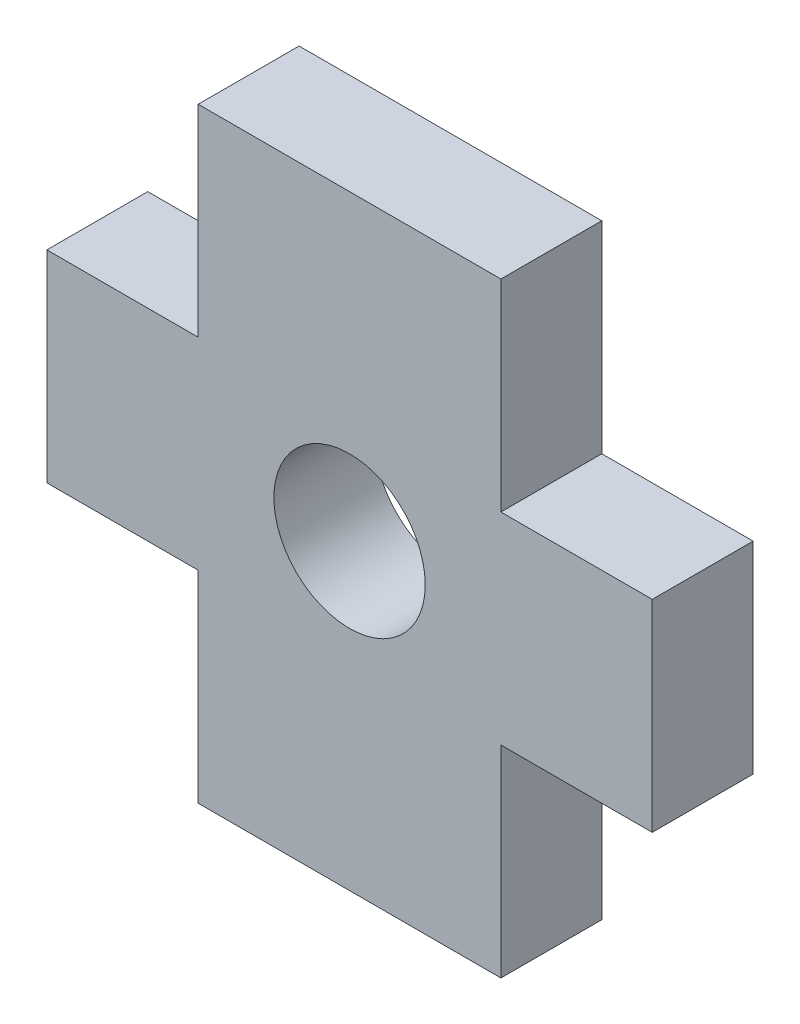
ISO-10303-21;
HEADER;
FILE_DESCRIPTION(('STEP AP214'),'2;1');
FILE_NAME('part.step','',(''),(''),'','','');
FILE_SCHEMA(('AUTOMOTIVE_DESIGN { 1 0 10303 214 1 1 1 1 }'));
ENDSEC;
DATA;
#1=APPLICATION_CONTEXT('core data for automotive mechanical design processes');
#2=APPLICATION_PROTOCOL_DEFINITION('international standard','automotive_design',2000,#1);
#3=PRODUCT_CONTEXT('',#1,'mechanical');
#4=PRODUCT('Part','Part','',(#3));
#5=PRODUCT_RELATED_PRODUCT_CATEGORY('part','',(#4));
#6=PRODUCT_DEFINITION_FORMATION('','',#4);
#7=PRODUCT_DEFINITION_CONTEXT('part definition',#1,'design');
#8=PRODUCT_DEFINITION('design','',#6,#7);
#9=PRODUCT_DEFINITION_SHAPE('','',#8);
#10=(LENGTH_UNIT() NAMED_UNIT(*) SI_UNIT(.MILLI.,.METRE.));
#11=(NAMED_UNIT(*) PLANE_ANGLE_UNIT() SI_UNIT($,.RADIAN.));
#12=(NAMED_UNIT(*) SI_UNIT($,.STERADIAN.) SOLID_ANGLE_UNIT());
#13=UNCERTAINTY_MEASURE_WITH_UNIT(LENGTH_MEASURE(1.E-05),#10,'distance_accuracy_value','');
#14=(GEOMETRIC_REPRESENTATION_CONTEXT(3) GLOBAL_UNCERTAINTY_ASSIGNED_CONTEXT((#13)) GLOBAL_UNIT_ASSIGNED_CONTEXT((#10,
#11,#12)) REPRESENTATION_CONTEXT('',''));
#15=CARTESIAN_POINT('',(0.,0.,0.));
#16=DIRECTION('',(0.,0.,1.));
#17=DIRECTION('',(1.,0.,0.));
#18=AXIS2_PLACEMENT_3D('',#15,#16,#17);
#19=CARTESIAN_POINT('',(0.,0.,2.));
#20=DIRECTION('',(0.,0.,1.));
#21=DIRECTION('',(1.,0.,0.));
#22=AXIS2_PLACEMENT_3D('',#19,#20,#21);
#23=PLANE('',#22);
#24=DIRECTION('',(0.,-1.,0.));
#25=VECTOR('',#24,1.);
#26=CARTESIAN_POINT('',(-3.,-2.,2.));
#27=LINE('',#26,#25);
#28=CARTESIAN_POINT('',(-3.,-2.,2.));
#29=VERTEX_POINT('',#28);
#30=CARTESIAN_POINT('',(-3.,-6.,2.));
#31=VERTEX_POINT('',#30);
#32=EDGE_CURVE('E177',#29,#31,#27,.T.);
#33=ORIENTED_EDGE('',*,*,#32,.T.);
#34=DIRECTION('',(1.,0.,0.));
#35=VECTOR('',#34,1.);
#36=CARTESIAN_POINT('',(-3.,-6.,2.));
#37=LINE('',#36,#35);
#38=CARTESIAN_POINT('',(3.,-6.,2.));
#39=VERTEX_POINT('',#38);
#40=EDGE_CURVE('E105',#31,#39,#37,.T.);
#41=ORIENTED_EDGE('',*,*,#40,.T.);
#42=DIRECTION('',(0.,1.,0.));
#43=VECTOR('',#42,1.);
#44=CARTESIAN_POINT('',(3.,-6.,2.));
#45=LINE('',#44,#43);
#46=CARTESIAN_POINT('',(3.,-2.,2.));
#47=VERTEX_POINT('',#46);
#48=EDGE_CURVE('E204',#39,#47,#45,.T.);
#49=ORIENTED_EDGE('',*,*,#48,.T.);
#50=DIRECTION('',(1.,0.,0.));
#51=VECTOR('',#50,1.);
#52=CARTESIAN_POINT('',(3.,-2.,2.));
#53=LINE('',#52,#51);
#54=CARTESIAN_POINT('',(6.,-2.,2.));
#55=VERTEX_POINT('',#54);
#56=EDGE_CURVE('E223',#47,#55,#53,.T.);
#57=ORIENTED_EDGE('',*,*,#56,.T.);
#58=DIRECTION('',(0.,1.,0.));
#59=VECTOR('',#58,1.);
#60=CARTESIAN_POINT('',(6.,-2.,2.));
#61=LINE('',#60,#59);
#62=CARTESIAN_POINT('',(6.,2.,2.));
#63=VERTEX_POINT('',#62);
#64=EDGE_CURVE('E220',#55,#63,#61,.T.);
#65=ORIENTED_EDGE('',*,*,#64,.T.);
#66=DIRECTION('',(-1.,0.,0.));
#67=VECTOR('',#66,1.);
#68=CARTESIAN_POINT('',(3.,2.,2.));
#69=LINE('',#68,#67);
#70=CARTESIAN_POINT('',(3.,2.,2.));
#71=VERTEX_POINT('',#70);
#72=EDGE_CURVE('E222',#63,#71,#69,.T.);
#73=ORIENTED_EDGE('',*,*,#72,.T.);
#74=DIRECTION('',(0.,1.,0.));
#75=VECTOR('',#74,1.);
#76=CARTESIAN_POINT('',(3.,2.,2.));
#77=LINE('',#76,#75);
#78=CARTESIAN_POINT('',(3.,6.,2.));
#79=VERTEX_POINT('',#78);
#80=EDGE_CURVE('E225',#71,#79,#77,.T.);
#81=ORIENTED_EDGE('',*,*,#80,.T.);
#82=DIRECTION('',(-1.,0.,0.));
#83=VECTOR('',#82,1.);
#84=CARTESIAN_POINT('',(3.,6.,2.));
#85=LINE('',#84,#83);
#86=CARTESIAN_POINT('',(-3.,6.,2.));
#87=VERTEX_POINT('',#86);
#88=EDGE_CURVE('E231',#79,#87,#85,.T.);
#89=ORIENTED_EDGE('',*,*,#88,.T.);
#90=DIRECTION('',(0.,-1.,0.));
#91=VECTOR('',#90,1.);
#92=CARTESIAN_POINT('',(-3.,6.,2.));
#93=LINE('',#92,#91);
#94=CARTESIAN_POINT('',(-3.,2.,2.));
#95=VERTEX_POINT('',#94);
#96=EDGE_CURVE('E136',#87,#95,#93,.T.);
#97=ORIENTED_EDGE('',*,*,#96,.T.);
#98=DIRECTION('',(-1.,0.,0.));
#99=VECTOR('',#98,1.);
#100=CARTESIAN_POINT('',(-3.,2.,2.));
#101=LINE('',#100,#99);
#102=CARTESIAN_POINT('',(-6.,2.,2.));
#103=VERTEX_POINT('',#102);
#104=EDGE_CURVE('E130',#95,#103,#101,.T.);
#105=ORIENTED_EDGE('',*,*,#104,.T.);
#106=DIRECTION('',(0.,-1.,0.));
#107=VECTOR('',#106,1.);
#108=CARTESIAN_POINT('',(-6.,2.,2.));
#109=LINE('',#108,#107);
#110=CARTESIAN_POINT('',(-6.,-2.,2.));
#111=VERTEX_POINT('',#110);
#112=EDGE_CURVE('E134',#103,#111,#109,.T.);
#113=ORIENTED_EDGE('',*,*,#112,.T.);
#114=DIRECTION('',(1.,0.,0.));
#115=VECTOR('',#114,1.);
#116=CARTESIAN_POINT('',(-6.,-2.,2.));
#117=LINE('',#116,#115);
#118=EDGE_CURVE('E50',#111,#29,#117,.T.);
#119=ORIENTED_EDGE('',*,*,#118,.T.);
#120=EDGE_LOOP('',(#33,#41,#49,#57,#65,#73,#81,#89,#97,#105,#113,#119));
#121=FACE_BOUND('',#120,.T.);
#122=CARTESIAN_POINT('',(0.,0.,2.));
#123=DIRECTION('',(0.,0.,1.));
#124=DIRECTION('',(1.,0.,0.));
#125=AXIS2_PLACEMENT_3D('',#122,#123,#124);
#126=CIRCLE('',#125,1.5);
#127=CARTESIAN_POINT('',(1.5,0.,2.));
#128=VERTEX_POINT('',#127);
#129=EDGE_CURVE('E158',#128,#128,#126,.T.);
#130=ORIENTED_EDGE('',*,*,#129,.F.);
#131=EDGE_LOOP('',(#130));
#132=FACE_BOUND('',#131,.T.);
#133=ADVANCED_FACE('F33',(#121,#132),#23,.T.);
#134=CARTESIAN_POINT('',(0.,0.,0.));
#135=DIRECTION('',(0.,0.,1.));
#136=DIRECTION('',(1.,0.,0.));
#137=AXIS2_PLACEMENT_3D('',#134,#135,#136);
#138=PLANE('',#137);
#139=DIRECTION('',(0.,-1.,0.));
#140=VECTOR('',#139,1.);
#141=CARTESIAN_POINT('',(-3.,-2.,0.));
#142=LINE('',#141,#140);
#143=CARTESIAN_POINT('',(-3.,-2.,0.));
#144=VERTEX_POINT('',#143);
#145=CARTESIAN_POINT('',(-3.,-6.,0.));
#146=VERTEX_POINT('',#145);
#147=EDGE_CURVE('E154',#144,#146,#142,.T.);
#148=ORIENTED_EDGE('',*,*,#147,.F.);
#149=DIRECTION('',(1.,0.,0.));
#150=VECTOR('',#149,1.);
#151=CARTESIAN_POINT('',(-6.,-2.,0.));
#152=LINE('',#151,#150);
#153=CARTESIAN_POINT('',(-6.,-2.,0.));
#154=VERTEX_POINT('',#153);
#155=EDGE_CURVE('E97',#154,#144,#152,.T.);
#156=ORIENTED_EDGE('',*,*,#155,.F.);
#157=DIRECTION('',(0.,-1.,0.));
#158=VECTOR('',#157,1.);
#159=CARTESIAN_POINT('',(-6.,2.,0.));
#160=LINE('',#159,#158);
#161=CARTESIAN_POINT('',(-6.,2.,0.));
#162=VERTEX_POINT('',#161);
#163=EDGE_CURVE('E91',#162,#154,#160,.T.);
#164=ORIENTED_EDGE('',*,*,#163,.F.);
#165=DIRECTION('',(-1.,0.,0.));
#166=VECTOR('',#165,1.);
#167=CARTESIAN_POINT('',(-3.,2.,0.));
#168=LINE('',#167,#166);
#169=CARTESIAN_POINT('',(-3.,2.,0.));
#170=VERTEX_POINT('',#169);
#171=EDGE_CURVE('E144',#170,#162,#168,.T.);
#172=ORIENTED_EDGE('',*,*,#171,.F.);
#173=DIRECTION('',(0.,-1.,0.));
#174=VECTOR('',#173,1.);
#175=CARTESIAN_POINT('',(-3.,6.,0.));
#176=LINE('',#175,#174);
#177=CARTESIAN_POINT('',(-3.,6.,0.));
#178=VERTEX_POINT('',#177);
#179=EDGE_CURVE('E172',#178,#170,#176,.T.);
#180=ORIENTED_EDGE('',*,*,#179,.F.);
#181=DIRECTION('',(-1.,0.,0.));
#182=VECTOR('',#181,1.);
#183=CARTESIAN_POINT('',(3.,6.,0.));
#184=LINE('',#183,#182);
#185=CARTESIAN_POINT('',(3.,6.,0.));
#186=VERTEX_POINT('',#185);
#187=EDGE_CURVE('E170',#186,#178,#184,.T.);
#188=ORIENTED_EDGE('',*,*,#187,.F.);
#189=DIRECTION('',(0.,1.,0.));
#190=VECTOR('',#189,1.);
#191=CARTESIAN_POINT('',(3.,2.,0.));
#192=LINE('',#191,#190);
#193=CARTESIAN_POINT('',(3.,2.,0.));
#194=VERTEX_POINT('',#193);
#195=EDGE_CURVE('E168',#194,#186,#192,.T.);
#196=ORIENTED_EDGE('',*,*,#195,.F.);
#197=DIRECTION('',(-1.,0.,0.));
#198=VECTOR('',#197,1.);
#199=CARTESIAN_POINT('',(3.,2.,0.));
#200=LINE('',#199,#198);
#201=CARTESIAN_POINT('',(6.,2.,0.));
#202=VERTEX_POINT('',#201);
#203=EDGE_CURVE('E166',#202,#194,#200,.T.);
#204=ORIENTED_EDGE('',*,*,#203,.F.);
#205=DIRECTION('',(0.,1.,0.));
#206=VECTOR('',#205,1.);
#207=CARTESIAN_POINT('',(6.,-2.,0.));
#208=LINE('',#207,#206);
#209=CARTESIAN_POINT('',(6.,-2.,0.));
#210=VERTEX_POINT('',#209);
#211=EDGE_CURVE('E164',#210,#202,#208,.T.);
#212=ORIENTED_EDGE('',*,*,#211,.F.);
#213=DIRECTION('',(1.,0.,0.));
#214=VECTOR('',#213,1.);
#215=CARTESIAN_POINT('',(3.,-2.,0.));
#216=LINE('',#215,#214);
#217=CARTESIAN_POINT('',(3.,-2.,0.));
#218=VERTEX_POINT('',#217);
#219=EDGE_CURVE('E162',#218,#210,#216,.T.);
#220=ORIENTED_EDGE('',*,*,#219,.F.);
#221=DIRECTION('',(0.,1.,0.));
#222=VECTOR('',#221,1.);
#223=CARTESIAN_POINT('',(3.,-6.,0.));
#224=LINE('',#223,#222);
#225=CARTESIAN_POINT('',(3.,-6.,0.));
#226=VERTEX_POINT('',#225);
#227=EDGE_CURVE('E160',#226,#218,#224,.T.);
#228=ORIENTED_EDGE('',*,*,#227,.F.);
#229=DIRECTION('',(1.,0.,0.));
#230=VECTOR('',#229,1.);
#231=CARTESIAN_POINT('',(-3.,-6.,0.));
#232=LINE('',#231,#230);
#233=EDGE_CURVE('E157',#146,#226,#232,.T.);
#234=ORIENTED_EDGE('',*,*,#233,.F.);
#235=EDGE_LOOP('',(#148,#156,#164,#172,#180,#188,#196,#204,#212,#220,#228,#234));
#236=FACE_BOUND('',#235,.T.);
#237=CARTESIAN_POINT('',(0.,0.,0.));
#238=DIRECTION('',(0.,0.,1.));
#239=DIRECTION('',(1.,0.,0.));
#240=AXIS2_PLACEMENT_3D('',#237,#238,#239);
#241=CIRCLE('',#240,1.5);
#242=CARTESIAN_POINT('',(1.5,0.,0.));
#243=VERTEX_POINT('',#242);
#244=EDGE_CURVE('E378',#243,#243,#241,.T.);
#245=ORIENTED_EDGE('',*,*,#244,.T.);
#246=EDGE_LOOP('',(#245));
#247=FACE_BOUND('',#246,.T.);
#248=ADVANCED_FACE('F208',(#236,#247),#138,.F.);
#249=CARTESIAN_POINT('',(-3.,-2.,2.));
#250=DIRECTION('',(1.,0.,0.));
#251=DIRECTION('',(0.,0.,-1.));
#252=AXIS2_PLACEMENT_3D('',#249,#250,#251);
#253=PLANE('',#252);
#254=ORIENTED_EDGE('',*,*,#147,.T.);
#255=DIRECTION('',(0.,0.,-1.));
#256=VECTOR('',#255,1.);
#257=CARTESIAN_POINT('',(-3.,-6.,2.));
#258=LINE('',#257,#256);
#259=EDGE_CURVE('E11',#31,#146,#258,.T.);
#260=ORIENTED_EDGE('',*,*,#259,.F.);
#261=ORIENTED_EDGE('',*,*,#32,.F.);
#262=DIRECTION('',(0.,0.,-1.));
#263=VECTOR('',#262,1.);
#264=CARTESIAN_POINT('',(-3.,-2.,2.));
#265=LINE('',#264,#263);
#266=EDGE_CURVE('E150',#29,#144,#265,.T.);
#267=ORIENTED_EDGE('',*,*,#266,.T.);
#268=EDGE_LOOP('',(#254,#260,#261,#267));
#269=FACE_BOUND('',#268,.T.);
#270=ADVANCED_FACE('F35',(#269),#253,.F.);
#271=CARTESIAN_POINT('',(-3.,-6.,2.));
#272=DIRECTION('',(0.,1.,0.));
#273=DIRECTION('',(0.,0.,1.));
#274=AXIS2_PLACEMENT_3D('',#271,#272,#273);
#275=PLANE('',#274);
#276=ORIENTED_EDGE('',*,*,#233,.T.);
#277=DIRECTION('',(0.,0.,-1.));
#278=VECTOR('',#277,1.);
#279=CARTESIAN_POINT('',(3.,-6.,2.));
#280=LINE('',#279,#278);
#281=EDGE_CURVE('E42',#39,#226,#280,.T.);
#282=ORIENTED_EDGE('',*,*,#281,.F.);
#283=ORIENTED_EDGE('',*,*,#40,.F.);
#284=ORIENTED_EDGE('',*,*,#259,.T.);
#285=EDGE_LOOP('',(#276,#282,#283,#284));
#286=FACE_BOUND('',#285,.T.);
#287=ADVANCED_FACE('F265',(#286),#275,.F.);
#288=CARTESIAN_POINT('',(3.,-6.,2.));
#289=DIRECTION('',(-1.,0.,0.));
#290=DIRECTION('',(0.,0.,1.));
#291=AXIS2_PLACEMENT_3D('',#288,#289,#290);
#292=PLANE('',#291);
#293=ORIENTED_EDGE('',*,*,#227,.T.);
#294=DIRECTION('',(0.,0.,-1.));
#295=VECTOR('',#294,1.);
#296=CARTESIAN_POINT('',(3.,-2.,2.));
#297=LINE('',#296,#295);
#298=EDGE_CURVE('E196',#47,#218,#297,.T.);
#299=ORIENTED_EDGE('',*,*,#298,.F.);
#300=ORIENTED_EDGE('',*,*,#48,.F.);
#301=ORIENTED_EDGE('',*,*,#281,.T.);
#302=EDGE_LOOP('',(#293,#299,#300,#301));
#303=FACE_BOUND('',#302,.T.);
#304=ADVANCED_FACE('F202',(#303),#292,.F.);
#305=CARTESIAN_POINT('',(3.,-2.,2.));
#306=DIRECTION('',(0.,1.,0.));
#307=DIRECTION('',(0.,0.,1.));
#308=AXIS2_PLACEMENT_3D('',#305,#306,#307);
#309=PLANE('',#308);
#310=ORIENTED_EDGE('',*,*,#219,.T.);
#311=DIRECTION('',(0.,0.,-1.));
#312=VECTOR('',#311,1.);
#313=CARTESIAN_POINT('',(6.,-2.,2.));
#314=LINE('',#313,#312);
#315=EDGE_CURVE('E193',#55,#210,#314,.T.);
#316=ORIENTED_EDGE('',*,*,#315,.F.);
#317=ORIENTED_EDGE('',*,*,#56,.F.);
#318=ORIENTED_EDGE('',*,*,#298,.T.);
#319=EDGE_LOOP('',(#310,#316,#317,#318));
#320=FACE_BOUND('',#319,.T.);
#321=ADVANCED_FACE('F214',(#320),#309,.F.);
#322=CARTESIAN_POINT('',(6.,-2.,2.));
#323=DIRECTION('',(-1.,0.,0.));
#324=DIRECTION('',(0.,0.,1.));
#325=AXIS2_PLACEMENT_3D('',#322,#323,#324);
#326=PLANE('',#325);
#327=ORIENTED_EDGE('',*,*,#211,.T.);
#328=DIRECTION('',(0.,0.,-1.));
#329=VECTOR('',#328,1.);
#330=CARTESIAN_POINT('',(6.,2.,2.));
#331=LINE('',#330,#329);
#332=EDGE_CURVE('E190',#63,#202,#331,.T.);
#333=ORIENTED_EDGE('',*,*,#332,.F.);
#334=ORIENTED_EDGE('',*,*,#64,.F.);
#335=ORIENTED_EDGE('',*,*,#315,.T.);
#336=EDGE_LOOP('',(#327,#333,#334,#335));
#337=FACE_BOUND('',#336,.T.);
#338=ADVANCED_FACE('F218',(#337),#326,.F.);
#339=CARTESIAN_POINT('',(3.,2.,2.));
#340=DIRECTION('',(0.,-1.,0.));
#341=DIRECTION('',(0.,0.,-1.));
#342=AXIS2_PLACEMENT_3D('',#339,#340,#341);
#343=PLANE('',#342);
#344=ORIENTED_EDGE('',*,*,#203,.T.);
#345=DIRECTION('',(0.,0.,-1.));
#346=VECTOR('',#345,1.);
#347=CARTESIAN_POINT('',(3.,2.,2.));
#348=LINE('',#347,#346);
#349=EDGE_CURVE('E187',#71,#194,#348,.T.);
#350=ORIENTED_EDGE('',*,*,#349,.F.);
#351=ORIENTED_EDGE('',*,*,#72,.F.);
#352=ORIENTED_EDGE('',*,*,#332,.T.);
#353=EDGE_LOOP('',(#344,#350,#351,#352));
#354=FACE_BOUND('',#353,.T.);
#355=ADVANCED_FACE('F278',(#354),#343,.F.);
#356=CARTESIAN_POINT('',(3.,2.,2.));
#357=DIRECTION('',(-1.,0.,0.));
#358=DIRECTION('',(0.,0.,1.));
#359=AXIS2_PLACEMENT_3D('',#356,#357,#358);
#360=PLANE('',#359);
#361=ORIENTED_EDGE('',*,*,#195,.T.);
#362=DIRECTION('',(0.,0.,-1.));
#363=VECTOR('',#362,1.);
#364=CARTESIAN_POINT('',(3.,6.,2.));
#365=LINE('',#364,#363);
#366=EDGE_CURVE('E184',#79,#186,#365,.T.);
#367=ORIENTED_EDGE('',*,*,#366,.F.);
#368=ORIENTED_EDGE('',*,*,#80,.F.);
#369=ORIENTED_EDGE('',*,*,#349,.T.);
#370=EDGE_LOOP('',(#361,#367,#368,#369));
#371=FACE_BOUND('',#370,.T.);
#372=ADVANCED_FACE('F281',(#371),#360,.F.);
#373=CARTESIAN_POINT('',(3.,6.,2.));
#374=DIRECTION('',(0.,-1.,0.));
#375=DIRECTION('',(0.,0.,-1.));
#376=AXIS2_PLACEMENT_3D('',#373,#374,#375);
#377=PLANE('',#376);
#378=ORIENTED_EDGE('',*,*,#187,.T.);
#379=DIRECTION('',(0.,0.,-1.));
#380=VECTOR('',#379,1.);
#381=CARTESIAN_POINT('',(-3.,6.,2.));
#382=LINE('',#381,#380);
#383=EDGE_CURVE('E181',#87,#178,#382,.T.);
#384=ORIENTED_EDGE('',*,*,#383,.F.);
#385=ORIENTED_EDGE('',*,*,#88,.F.);
#386=ORIENTED_EDGE('',*,*,#366,.T.);
#387=EDGE_LOOP('',(#378,#384,#385,#386));
#388=FACE_BOUND('',#387,.T.);
#389=ADVANCED_FACE('F237',(#388),#377,.F.);
#390=CARTESIAN_POINT('',(-3.,6.,2.));
#391=DIRECTION('',(1.,0.,0.));
#392=DIRECTION('',(0.,0.,-1.));
#393=AXIS2_PLACEMENT_3D('',#390,#391,#392);
#394=PLANE('',#393);
#395=ORIENTED_EDGE('',*,*,#179,.T.);
#396=DIRECTION('',(0.,0.,-1.));
#397=VECTOR('',#396,1.);
#398=CARTESIAN_POINT('',(-3.,2.,2.));
#399=LINE('',#398,#397);
#400=EDGE_CURVE('E145',#95,#170,#399,.T.);
#401=ORIENTED_EDGE('',*,*,#400,.F.);
#402=ORIENTED_EDGE('',*,*,#96,.F.);
#403=ORIENTED_EDGE('',*,*,#383,.T.);
#404=EDGE_LOOP('',(#395,#401,#402,#403));
#405=FACE_BOUND('',#404,.T.);
#406=ADVANCED_FACE('F241',(#405),#394,.F.);
#407=CARTESIAN_POINT('',(-3.,2.,2.));
#408=DIRECTION('',(0.,-1.,0.));
#409=DIRECTION('',(0.,0.,-1.));
#410=AXIS2_PLACEMENT_3D('',#407,#408,#409);
#411=PLANE('',#410);
#412=ORIENTED_EDGE('',*,*,#171,.T.);
#413=DIRECTION('',(0.,0.,-1.));
#414=VECTOR('',#413,1.);
#415=CARTESIAN_POINT('',(-6.,2.,2.));
#416=LINE('',#415,#414);
#417=EDGE_CURVE('E141',#103,#162,#416,.T.);
#418=ORIENTED_EDGE('',*,*,#417,.F.);
#419=ORIENTED_EDGE('',*,*,#104,.F.);
#420=ORIENTED_EDGE('',*,*,#400,.T.);
#421=EDGE_LOOP('',(#412,#418,#419,#420));
#422=FACE_BOUND('',#421,.T.);
#423=ADVANCED_FACE('F142',(#422),#411,.F.);
#424=CARTESIAN_POINT('',(-6.,2.,2.));
#425=DIRECTION('',(1.,0.,0.));
#426=DIRECTION('',(0.,0.,-1.));
#427=AXIS2_PLACEMENT_3D('',#424,#425,#426);
#428=PLANE('',#427);
#429=ORIENTED_EDGE('',*,*,#163,.T.);
#430=DIRECTION('',(0.,0.,-1.));
#431=VECTOR('',#430,1.);
#432=CARTESIAN_POINT('',(-6.,-2.,2.));
#433=LINE('',#432,#431);
#434=EDGE_CURVE('E146',#111,#154,#433,.T.);
#435=ORIENTED_EDGE('',*,*,#434,.F.);
#436=ORIENTED_EDGE('',*,*,#112,.F.);
#437=ORIENTED_EDGE('',*,*,#417,.T.);
#438=EDGE_LOOP('',(#429,#435,#436,#437));
#439=FACE_BOUND('',#438,.T.);
#440=ADVANCED_FACE('F148',(#439),#428,.F.);
#441=CARTESIAN_POINT('',(-6.,-2.,2.));
#442=DIRECTION('',(0.,1.,0.));
#443=DIRECTION('',(0.,0.,1.));
#444=AXIS2_PLACEMENT_3D('',#441,#442,#443);
#445=PLANE('',#444);
#446=ORIENTED_EDGE('',*,*,#155,.T.);
#447=ORIENTED_EDGE('',*,*,#266,.F.);
#448=ORIENTED_EDGE('',*,*,#118,.F.);
#449=ORIENTED_EDGE('',*,*,#434,.T.);
#450=EDGE_LOOP('',(#446,#447,#448,#449));
#451=FACE_BOUND('',#450,.T.);
#452=ADVANCED_FACE('F245',(#451),#445,.F.);
#453=CARTESIAN_POINT('',(0.,0.,2.));
#454=DIRECTION('',(0.,0.,-1.));
#455=DIRECTION('',(-1.,0.,0.));
#456=AXIS2_PLACEMENT_3D('',#453,#454,#455);
#457=CYLINDRICAL_SURFACE('',#456,1.5);
#458=ORIENTED_EDGE('',*,*,#129,.T.);
#459=EDGE_LOOP('',(#458));
#460=FACE_BOUND('',#459,.T.);
#461=ORIENTED_EDGE('',*,*,#244,.F.);
#462=EDGE_LOOP('',(#461));
#463=FACE_BOUND('',#462,.T.);
#464=ADVANCED_FACE('F247',(#460,#463),#457,.F.);
#465=CLOSED_SHELL('',(#133,#248,#270,#287,#304,#321,#338,#355,#372,#389,#406,#423,#440,#452,#464));
#466=MANIFOLD_SOLID_BREP('B2',#465);
#467=ADVANCED_BREP_SHAPE_REPRESENTATION('',(#18,#466),#14);
#468=SHAPE_DEFINITION_REPRESENTATION(#9,#467);
ENDSEC;
END-ISO-10303-21;
